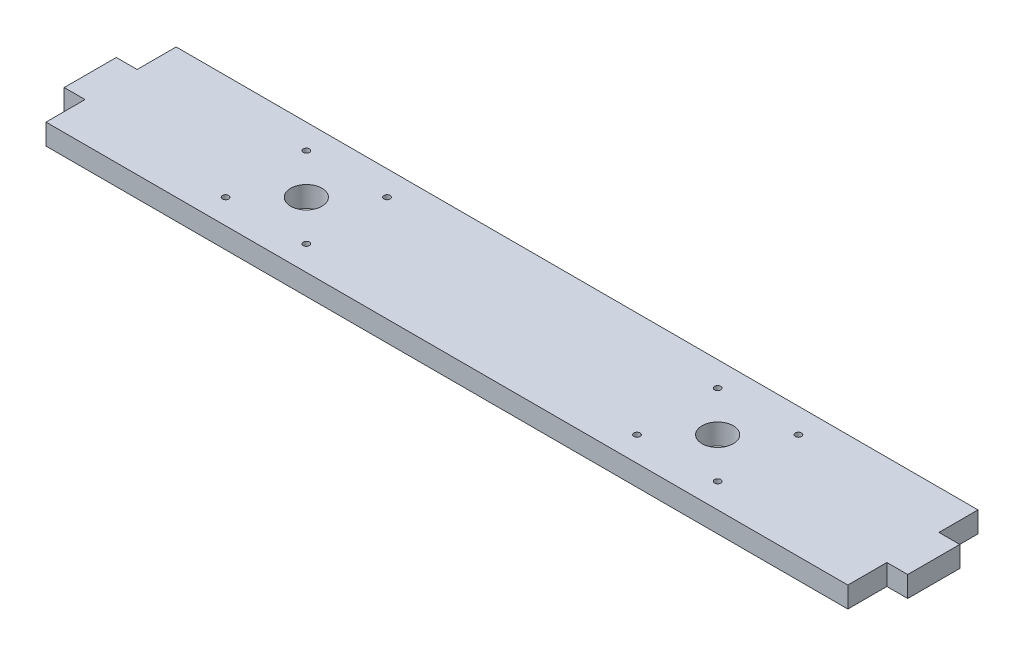
ISO-10303-21;
HEADER;
FILE_DESCRIPTION(('STEP AP214'),'2;1');
FILE_NAME('part.step','',(''),(''),'','','');
FILE_SCHEMA(('AUTOMOTIVE_DESIGN { 1 0 10303 214 1 1 1 1 }'));
ENDSEC;
DATA;
#1=APPLICATION_CONTEXT('core data for automotive mechanical design processes');
#2=APPLICATION_PROTOCOL_DEFINITION('international standard','automotive_design',2000,#1);
#3=PRODUCT_CONTEXT('',#1,'mechanical');
#4=PRODUCT('Part','Part','',(#3));
#5=PRODUCT_RELATED_PRODUCT_CATEGORY('part','',(#4));
#6=PRODUCT_DEFINITION_FORMATION('','',#4);
#7=PRODUCT_DEFINITION_CONTEXT('part definition',#1,'design');
#8=PRODUCT_DEFINITION('design','',#6,#7);
#9=PRODUCT_DEFINITION_SHAPE('','',#8);
#10=(LENGTH_UNIT() NAMED_UNIT(*) SI_UNIT(.MILLI.,.METRE.));
#11=(NAMED_UNIT(*) PLANE_ANGLE_UNIT() SI_UNIT($,.RADIAN.));
#12=(NAMED_UNIT(*) SI_UNIT($,.STERADIAN.) SOLID_ANGLE_UNIT());
#13=UNCERTAINTY_MEASURE_WITH_UNIT(LENGTH_MEASURE(1.E-05),#10,'distance_accuracy_value','');
#14=(GEOMETRIC_REPRESENTATION_CONTEXT(3) GLOBAL_UNCERTAINTY_ASSIGNED_CONTEXT((#13)) GLOBAL_UNIT_ASSIGNED_CONTEXT((#10,
#11,#12)) REPRESENTATION_CONTEXT('',''));
#15=CARTESIAN_POINT('',(0.,0.,0.));
#16=DIRECTION('',(0.,0.,1.));
#17=DIRECTION('',(1.,0.,0.));
#18=AXIS2_PLACEMENT_3D('',#15,#16,#17);
#19=CARTESIAN_POINT('',(308.,8.,0.));
#20=DIRECTION('',(-1.,0.,0.));
#21=DIRECTION('',(0.,0.,1.));
#22=AXIS2_PLACEMENT_3D('',#19,#20,#21);
#23=PLANE('',#22);
#24=DIRECTION('',(0.,1.,0.));
#25=VECTOR('',#24,1.);
#26=CARTESIAN_POINT('',(308.,0.,-35.));
#27=LINE('',#26,#25);
#28=CARTESIAN_POINT('',(308.,0.,-35.));
#29=VERTEX_POINT('',#28);
#30=CARTESIAN_POINT('',(308.,8.,-35.));
#31=VERTEX_POINT('',#30);
#32=EDGE_CURVE('E124',#29,#31,#27,.T.);
#33=ORIENTED_EDGE('',*,*,#32,.F.);
#34=DIRECTION('',(0.,0.,-1.));
#35=VECTOR('',#34,1.);
#36=CARTESIAN_POINT('',(308.,0.,0.));
#37=LINE('',#36,#35);
#38=CARTESIAN_POINT('',(308.,0.,-50.));
#39=VERTEX_POINT('',#38);
#40=EDGE_CURVE('E137',#29,#39,#37,.T.);
#41=ORIENTED_EDGE('',*,*,#40,.T.);
#42=DIRECTION('',(0.,-1.,0.));
#43=VECTOR('',#42,1.);
#44=CARTESIAN_POINT('',(308.,8.,-50.));
#45=LINE('',#44,#43);
#46=CARTESIAN_POINT('',(308.,8.,-50.));
#47=VERTEX_POINT('',#46);
#48=EDGE_CURVE('E170',#47,#39,#45,.T.);
#49=ORIENTED_EDGE('',*,*,#48,.F.);
#50=DIRECTION('',(0.,0.,-1.));
#51=VECTOR('',#50,1.);
#52=CARTESIAN_POINT('',(308.,8.,0.));
#53=LINE('',#52,#51);
#54=EDGE_CURVE('E139',#31,#47,#53,.T.);
#55=ORIENTED_EDGE('',*,*,#54,.F.);
#56=EDGE_LOOP('',(#33,#41,#49,#55));
#57=FACE_BOUND('',#56,.T.);
#58=ADVANCED_FACE('F30',(#57),#23,.F.);
#59=CARTESIAN_POINT('',(0.,8.,0.));
#60=DIRECTION('',(1.,0.,0.));
#61=DIRECTION('',(0.,0.,-1.));
#62=AXIS2_PLACEMENT_3D('',#59,#60,#61);
#63=PLANE('',#62);
#64=DIRECTION('',(0.,1.,0.));
#65=VECTOR('',#64,1.);
#66=CARTESIAN_POINT('',(0.,0.,-15.));
#67=LINE('',#66,#65);
#68=CARTESIAN_POINT('',(0.,0.,-15.));
#69=VERTEX_POINT('',#68);
#70=CARTESIAN_POINT('',(0.,8.,-15.));
#71=VERTEX_POINT('',#70);
#72=EDGE_CURVE('E262',#69,#71,#67,.T.);
#73=ORIENTED_EDGE('',*,*,#72,.F.);
#74=DIRECTION('',(0.,0.,1.));
#75=VECTOR('',#74,1.);
#76=CARTESIAN_POINT('',(0.,0.,0.));
#77=LINE('',#76,#75);
#78=CARTESIAN_POINT('',(0.,0.,0.));
#79=VERTEX_POINT('',#78);
#80=EDGE_CURVE('E177',#69,#79,#77,.T.);
#81=ORIENTED_EDGE('',*,*,#80,.T.);
#82=DIRECTION('',(0.,-1.,0.));
#83=VECTOR('',#82,1.);
#84=CARTESIAN_POINT('',(0.,8.,0.));
#85=LINE('',#84,#83);
#86=CARTESIAN_POINT('',(0.,8.,0.));
#87=VERTEX_POINT('',#86);
#88=EDGE_CURVE('E11',#87,#79,#85,.T.);
#89=ORIENTED_EDGE('',*,*,#88,.F.);
#90=DIRECTION('',(0.,0.,1.));
#91=VECTOR('',#90,1.);
#92=CARTESIAN_POINT('',(0.,8.,0.));
#93=LINE('',#92,#91);
#94=EDGE_CURVE('E166',#71,#87,#93,.T.);
#95=ORIENTED_EDGE('',*,*,#94,.F.);
#96=EDGE_LOOP('',(#73,#81,#89,#95));
#97=FACE_BOUND('',#96,.T.);
#98=ADVANCED_FACE('F261',(#97),#63,.F.);
#99=CARTESIAN_POINT('',(0.,8.,-50.));
#100=DIRECTION('',(0.,-1.,0.));
#101=DIRECTION('',(0.,0.,-1.));
#102=AXIS2_PLACEMENT_3D('',#99,#100,#101);
#103=PLANE('',#102);
#104=CARTESIAN_POINT('',(233.,8.,-25.));
#105=DIRECTION('',(0.,1.,0.));
#106=DIRECTION('',(0.,0.,-1.));
#107=AXIS2_PLACEMENT_3D('',#104,#105,#106);
#108=CIRCLE('',#107,5.99999999999999);
#109=CARTESIAN_POINT('',(233.,8.,-31.));
#110=VERTEX_POINT('',#109);
#111=EDGE_CURVE('E534',#110,#110,#108,.T.);
#112=ORIENTED_EDGE('',*,*,#111,.F.);
#113=EDGE_LOOP('',(#112));
#114=FACE_BOUND('',#113,.T.);
#115=CARTESIAN_POINT('',(248.5,8.,-9.5));
#116=DIRECTION('',(0.,1.,0.));
#117=DIRECTION('',(0.,0.,-1.));
#118=AXIS2_PLACEMENT_3D('',#115,#116,#117);
#119=CIRCLE('',#118,1.20000000000001);
#120=CARTESIAN_POINT('',(248.5,8.,-10.7));
#121=VERTEX_POINT('',#120);
#122=EDGE_CURVE('E547',#121,#121,#119,.T.);
#123=ORIENTED_EDGE('',*,*,#122,.F.);
#124=EDGE_LOOP('',(#123));
#125=FACE_BOUND('',#124,.T.);
#126=CARTESIAN_POINT('',(59.5000000000003,8.,-9.5));
#127=DIRECTION('',(0.,1.,0.));
#128=DIRECTION('',(0.,0.,1.));
#129=AXIS2_PLACEMENT_3D('',#126,#127,#128);
#130=CIRCLE('',#129,1.2);
#131=CARTESIAN_POINT('',(59.5000000000003,8.,-8.3));
#132=VERTEX_POINT('',#131);
#133=EDGE_CURVE('E559',#132,#132,#130,.T.);
#134=ORIENTED_EDGE('',*,*,#133,.F.);
#135=EDGE_LOOP('',(#134));
#136=FACE_BOUND('',#135,.T.);
#137=CARTESIAN_POINT('',(217.5,8.,-9.5));
#138=DIRECTION('',(0.,1.,0.));
#139=DIRECTION('',(0.,0.,-1.));
#140=AXIS2_PLACEMENT_3D('',#137,#138,#139);
#141=CIRCLE('',#140,1.20000000000001);
#142=CARTESIAN_POINT('',(217.5,8.,-10.7));
#143=VERTEX_POINT('',#142);
#144=EDGE_CURVE('E571',#143,#143,#141,.T.);
#145=ORIENTED_EDGE('',*,*,#144,.F.);
#146=EDGE_LOOP('',(#145));
#147=FACE_BOUND('',#146,.T.);
#148=CARTESIAN_POINT('',(75.,8.,-25.));
#149=DIRECTION('',(0.,1.,0.));
#150=DIRECTION('',(0.,0.,1.));
#151=AXIS2_PLACEMENT_3D('',#148,#149,#150);
#152=CIRCLE('',#151,6.);
#153=CARTESIAN_POINT('',(75.,8.,-19.));
#154=VERTEX_POINT('',#153);
#155=EDGE_CURVE('E239',#154,#154,#152,.T.);
#156=ORIENTED_EDGE('',*,*,#155,.F.);
#157=EDGE_LOOP('',(#156));
#158=FACE_BOUND('',#157,.T.);
#159=CARTESIAN_POINT('',(0.,8.,-50.));
#160=VERTEX_POINT('',#159);
#161=CARTESIAN_POINT('',(0.,8.,-35.));
#162=VERTEX_POINT('',#161);
#163=EDGE_CURVE('E254',#160,#162,#93,.T.);
#164=ORIENTED_EDGE('',*,*,#163,.T.);
#165=DIRECTION('',(-1.,0.,0.));
#166=VECTOR('',#165,1.);
#167=CARTESIAN_POINT('',(0.,8.,-35.));
#168=LINE('',#167,#166);
#169=CARTESIAN_POINT('',(-8.,8.,-35.));
#170=VERTEX_POINT('',#169);
#171=EDGE_CURVE('E55',#162,#170,#168,.T.);
#172=ORIENTED_EDGE('',*,*,#171,.T.);
#173=DIRECTION('',(0.,0.,1.));
#174=VECTOR('',#173,1.);
#175=CARTESIAN_POINT('',(-8.,8.,-35.));
#176=LINE('',#175,#174);
#177=CARTESIAN_POINT('',(-8.,8.,-15.));
#178=VERTEX_POINT('',#177);
#179=EDGE_CURVE('E217',#170,#178,#176,.T.);
#180=ORIENTED_EDGE('',*,*,#179,.T.);
#181=DIRECTION('',(1.,0.,0.));
#182=VECTOR('',#181,1.);
#183=CARTESIAN_POINT('',(0.,8.,-15.));
#184=LINE('',#183,#182);
#185=EDGE_CURVE('E260',#178,#71,#184,.T.);
#186=ORIENTED_EDGE('',*,*,#185,.T.);
#187=ORIENTED_EDGE('',*,*,#94,.T.);
#188=DIRECTION('',(1.,0.,0.));
#189=VECTOR('',#188,1.);
#190=CARTESIAN_POINT('',(0.,8.,0.));
#191=LINE('',#190,#189);
#192=CARTESIAN_POINT('',(308.,8.,0.));
#193=VERTEX_POINT('',#192);
#194=EDGE_CURVE('E184',#87,#193,#191,.T.);
#195=ORIENTED_EDGE('',*,*,#194,.T.);
#196=CARTESIAN_POINT('',(308.,8.,-15.));
#197=VERTEX_POINT('',#196);
#198=EDGE_CURVE('E158',#193,#197,#53,.T.);
#199=ORIENTED_EDGE('',*,*,#198,.T.);
#200=DIRECTION('',(1.,0.,0.));
#201=VECTOR('',#200,1.);
#202=CARTESIAN_POINT('',(308.,8.,-15.));
#203=LINE('',#202,#201);
#204=CARTESIAN_POINT('',(316.,8.,-15.));
#205=VERTEX_POINT('',#204);
#206=EDGE_CURVE('E47',#197,#205,#203,.T.);
#207=ORIENTED_EDGE('',*,*,#206,.T.);
#208=DIRECTION('',(0.,0.,-1.));
#209=VECTOR('',#208,1.);
#210=CARTESIAN_POINT('',(316.,8.,-35.));
#211=LINE('',#210,#209);
#212=CARTESIAN_POINT('',(316.,8.,-35.));
#213=VERTEX_POINT('',#212);
#214=EDGE_CURVE('E132',#205,#213,#211,.T.);
#215=ORIENTED_EDGE('',*,*,#214,.T.);
#216=DIRECTION('',(-1.,0.,0.));
#217=VECTOR('',#216,1.);
#218=CARTESIAN_POINT('',(308.,8.,-35.));
#219=LINE('',#218,#217);
#220=EDGE_CURVE('E189',#213,#31,#219,.T.);
#221=ORIENTED_EDGE('',*,*,#220,.T.);
#222=ORIENTED_EDGE('',*,*,#54,.T.);
#223=DIRECTION('',(-1.,0.,0.));
#224=VECTOR('',#223,1.);
#225=CARTESIAN_POINT('',(0.,8.,-50.));
#226=LINE('',#225,#224);
#227=EDGE_CURVE('E171',#47,#160,#226,.T.);
#228=ORIENTED_EDGE('',*,*,#227,.T.);
#229=EDGE_LOOP('',(#164,#172,#180,#186,#187,#195,#199,#207,#215,#221,#222,#228));
#230=FACE_BOUND('',#229,.T.);
#231=CARTESIAN_POINT('',(59.5,8.,-40.5));
#232=DIRECTION('',(0.,1.,0.));
#233=DIRECTION('',(0.,0.,1.));
#234=AXIS2_PLACEMENT_3D('',#231,#232,#233);
#235=CIRCLE('',#234,1.2);
#236=CARTESIAN_POINT('',(59.5,8.,-39.3));
#237=VERTEX_POINT('',#236);
#238=EDGE_CURVE('E246',#237,#237,#235,.T.);
#239=ORIENTED_EDGE('',*,*,#238,.F.);
#240=EDGE_LOOP('',(#239));
#241=FACE_BOUND('',#240,.T.);
#242=CARTESIAN_POINT('',(90.5,8.,-40.5));
#243=DIRECTION('',(0.,1.,0.));
#244=DIRECTION('',(0.,0.,1.));
#245=AXIS2_PLACEMENT_3D('',#242,#243,#244);
#246=CIRCLE('',#245,1.2);
#247=CARTESIAN_POINT('',(90.5,8.,-39.3));
#248=VERTEX_POINT('',#247);
#249=EDGE_CURVE('E565',#248,#248,#246,.T.);
#250=ORIENTED_EDGE('',*,*,#249,.F.);
#251=EDGE_LOOP('',(#250));
#252=FACE_BOUND('',#251,.T.);
#253=CARTESIAN_POINT('',(90.5000000000003,8.,-9.5));
#254=DIRECTION('',(0.,1.,0.));
#255=DIRECTION('',(0.,0.,1.));
#256=AXIS2_PLACEMENT_3D('',#253,#254,#255);
#257=CIRCLE('',#256,1.2);
#258=CARTESIAN_POINT('',(90.5000000000003,8.,-8.3));
#259=VERTEX_POINT('',#258);
#260=EDGE_CURVE('E553',#259,#259,#257,.T.);
#261=ORIENTED_EDGE('',*,*,#260,.F.);
#262=EDGE_LOOP('',(#261));
#263=FACE_BOUND('',#262,.T.);
#264=CARTESIAN_POINT('',(217.5,8.,-40.5));
#265=DIRECTION('',(0.,1.,0.));
#266=DIRECTION('',(0.,0.,-1.));
#267=AXIS2_PLACEMENT_3D('',#264,#265,#266);
#268=CIRCLE('',#267,1.20000000000001);
#269=CARTESIAN_POINT('',(217.5,8.,-41.7));
#270=VERTEX_POINT('',#269);
#271=EDGE_CURVE('E541',#270,#270,#268,.T.);
#272=ORIENTED_EDGE('',*,*,#271,.F.);
#273=EDGE_LOOP('',(#272));
#274=FACE_BOUND('',#273,.T.);
#275=CARTESIAN_POINT('',(248.5,8.,-40.5));
#276=DIRECTION('',(0.,1.,0.));
#277=DIRECTION('',(0.,0.,-1.));
#278=AXIS2_PLACEMENT_3D('',#275,#276,#277);
#279=CIRCLE('',#278,1.20000000000001);
#280=CARTESIAN_POINT('',(248.5,8.,-41.7));
#281=VERTEX_POINT('',#280);
#282=EDGE_CURVE('E268',#281,#281,#279,.T.);
#283=ORIENTED_EDGE('',*,*,#282,.F.);
#284=EDGE_LOOP('',(#283));
#285=FACE_BOUND('',#284,.T.);
#286=ADVANCED_FACE('F210',(#114,#125,#136,#147,#158,#230,#241,#252,#263,#274,#285),#103,.F.);
#287=CARTESIAN_POINT('',(0.,0.,-50.));
#288=DIRECTION('',(0.,-1.,0.));
#289=DIRECTION('',(0.,0.,-1.));
#290=AXIS2_PLACEMENT_3D('',#287,#288,#289);
#291=PLANE('',#290);
#292=CARTESIAN_POINT('',(233.,0.,-25.));
#293=DIRECTION('',(0.,1.,0.));
#294=DIRECTION('',(0.,0.,-1.));
#295=AXIS2_PLACEMENT_3D('',#292,#293,#294);
#296=CIRCLE('',#295,5.99999999999999);
#297=CARTESIAN_POINT('',(233.,0.,-31.));
#298=VERTEX_POINT('',#297);
#299=EDGE_CURVE('E533',#298,#298,#296,.T.);
#300=ORIENTED_EDGE('',*,*,#299,.T.);
#301=EDGE_LOOP('',(#300));
#302=FACE_BOUND('',#301,.T.);
#303=CARTESIAN_POINT('',(248.5,0.,-9.5));
#304=DIRECTION('',(0.,1.,0.));
#305=DIRECTION('',(0.,0.,-1.));
#306=AXIS2_PLACEMENT_3D('',#303,#304,#305);
#307=CIRCLE('',#306,1.20000000000001);
#308=CARTESIAN_POINT('',(248.5,0.,-10.7));
#309=VERTEX_POINT('',#308);
#310=EDGE_CURVE('E544',#309,#309,#307,.T.);
#311=ORIENTED_EDGE('',*,*,#310,.T.);
#312=EDGE_LOOP('',(#311));
#313=FACE_BOUND('',#312,.T.);
#314=CARTESIAN_POINT('',(59.5000000000003,0.,-9.5));
#315=DIRECTION('',(0.,1.,0.));
#316=DIRECTION('',(0.,0.,1.));
#317=AXIS2_PLACEMENT_3D('',#314,#315,#316);
#318=CIRCLE('',#317,1.2);
#319=CARTESIAN_POINT('',(59.5000000000003,0.,-8.3));
#320=VERTEX_POINT('',#319);
#321=EDGE_CURVE('E556',#320,#320,#318,.T.);
#322=ORIENTED_EDGE('',*,*,#321,.T.);
#323=EDGE_LOOP('',(#322));
#324=FACE_BOUND('',#323,.T.);
#325=CARTESIAN_POINT('',(217.5,0.,-9.5));
#326=DIRECTION('',(0.,1.,0.));
#327=DIRECTION('',(0.,0.,-1.));
#328=AXIS2_PLACEMENT_3D('',#325,#326,#327);
#329=CIRCLE('',#328,1.20000000000001);
#330=CARTESIAN_POINT('',(217.5,0.,-10.7));
#331=VERTEX_POINT('',#330);
#332=EDGE_CURVE('E568',#331,#331,#329,.T.);
#333=ORIENTED_EDGE('',*,*,#332,.T.);
#334=EDGE_LOOP('',(#333));
#335=FACE_BOUND('',#334,.T.);
#336=CARTESIAN_POINT('',(75.,0.,-25.));
#337=DIRECTION('',(0.,1.,0.));
#338=DIRECTION('',(0.,0.,1.));
#339=AXIS2_PLACEMENT_3D('',#336,#337,#338);
#340=CIRCLE('',#339,6.);
#341=CARTESIAN_POINT('',(75.,0.,-19.));
#342=VERTEX_POINT('',#341);
#343=EDGE_CURVE('E241',#342,#342,#340,.T.);
#344=ORIENTED_EDGE('',*,*,#343,.T.);
#345=EDGE_LOOP('',(#344));
#346=FACE_BOUND('',#345,.T.);
#347=CARTESIAN_POINT('',(0.,0.,-50.));
#348=VERTEX_POINT('',#347);
#349=CARTESIAN_POINT('',(0.,0.,-35.));
#350=VERTEX_POINT('',#349);
#351=EDGE_CURVE('E153',#348,#350,#77,.T.);
#352=ORIENTED_EDGE('',*,*,#351,.F.);
#353=DIRECTION('',(-1.,0.,0.));
#354=VECTOR('',#353,1.);
#355=CARTESIAN_POINT('',(0.,0.,-50.));
#356=LINE('',#355,#354);
#357=EDGE_CURVE('E147',#39,#348,#356,.T.);
#358=ORIENTED_EDGE('',*,*,#357,.F.);
#359=ORIENTED_EDGE('',*,*,#40,.F.);
#360=DIRECTION('',(-1.,0.,0.));
#361=VECTOR('',#360,1.);
#362=CARTESIAN_POINT('',(308.,0.,-35.));
#363=LINE('',#362,#361);
#364=CARTESIAN_POINT('',(316.,0.,-35.));
#365=VERTEX_POINT('',#364);
#366=EDGE_CURVE('E120',#365,#29,#363,.T.);
#367=ORIENTED_EDGE('',*,*,#366,.F.);
#368=DIRECTION('',(0.,0.,-1.));
#369=VECTOR('',#368,1.);
#370=CARTESIAN_POINT('',(316.,0.,-35.));
#371=LINE('',#370,#369);
#372=CARTESIAN_POINT('',(316.,0.,-15.));
#373=VERTEX_POINT('',#372);
#374=EDGE_CURVE('E141',#373,#365,#371,.T.);
#375=ORIENTED_EDGE('',*,*,#374,.F.);
#376=DIRECTION('',(1.,0.,0.));
#377=VECTOR('',#376,1.);
#378=CARTESIAN_POINT('',(308.,0.,-15.));
#379=LINE('',#378,#377);
#380=CARTESIAN_POINT('',(308.,0.,-15.));
#381=VERTEX_POINT('',#380);
#382=EDGE_CURVE('E131',#381,#373,#379,.T.);
#383=ORIENTED_EDGE('',*,*,#382,.F.);
#384=CARTESIAN_POINT('',(308.,0.,0.));
#385=VERTEX_POINT('',#384);
#386=EDGE_CURVE('E148',#385,#381,#37,.T.);
#387=ORIENTED_EDGE('',*,*,#386,.F.);
#388=DIRECTION('',(1.,0.,0.));
#389=VECTOR('',#388,1.);
#390=CARTESIAN_POINT('',(0.,0.,0.));
#391=LINE('',#390,#389);
#392=EDGE_CURVE('E149',#79,#385,#391,.T.);
#393=ORIENTED_EDGE('',*,*,#392,.F.);
#394=ORIENTED_EDGE('',*,*,#80,.F.);
#395=DIRECTION('',(1.,0.,0.));
#396=VECTOR('',#395,1.);
#397=CARTESIAN_POINT('',(0.,0.,-15.));
#398=LINE('',#397,#396);
#399=CARTESIAN_POINT('',(-8.,0.,-15.));
#400=VERTEX_POINT('',#399);
#401=EDGE_CURVE('E236',#400,#69,#398,.T.);
#402=ORIENTED_EDGE('',*,*,#401,.F.);
#403=DIRECTION('',(0.,0.,1.));
#404=VECTOR('',#403,1.);
#405=CARTESIAN_POINT('',(-8.,0.,-35.));
#406=LINE('',#405,#404);
#407=CARTESIAN_POINT('',(-8.,0.,-35.));
#408=VERTEX_POINT('',#407);
#409=EDGE_CURVE('E202',#408,#400,#406,.T.);
#410=ORIENTED_EDGE('',*,*,#409,.F.);
#411=DIRECTION('',(-1.,0.,0.));
#412=VECTOR('',#411,1.);
#413=CARTESIAN_POINT('',(0.,0.,-35.));
#414=LINE('',#413,#412);
#415=EDGE_CURVE('E287',#350,#408,#414,.T.);
#416=ORIENTED_EDGE('',*,*,#415,.F.);
#417=EDGE_LOOP('',(#352,#358,#359,#367,#375,#383,#387,#393,#394,#402,#410,#416));
#418=FACE_BOUND('',#417,.T.);
#419=CARTESIAN_POINT('',(59.5,0.,-40.5));
#420=DIRECTION('',(0.,1.,0.));
#421=DIRECTION('',(0.,0.,1.));
#422=AXIS2_PLACEMENT_3D('',#419,#420,#421);
#423=CIRCLE('',#422,1.2);
#424=CARTESIAN_POINT('',(59.5,0.,-39.3));
#425=VERTEX_POINT('',#424);
#426=EDGE_CURVE('E249',#425,#425,#423,.T.);
#427=ORIENTED_EDGE('',*,*,#426,.T.);
#428=EDGE_LOOP('',(#427));
#429=FACE_BOUND('',#428,.T.);
#430=CARTESIAN_POINT('',(90.5,0.,-40.5));
#431=DIRECTION('',(0.,1.,0.));
#432=DIRECTION('',(0.,0.,1.));
#433=AXIS2_PLACEMENT_3D('',#430,#431,#432);
#434=CIRCLE('',#433,1.2);
#435=CARTESIAN_POINT('',(90.5,0.,-39.3));
#436=VERTEX_POINT('',#435);
#437=EDGE_CURVE('E562',#436,#436,#434,.T.);
#438=ORIENTED_EDGE('',*,*,#437,.T.);
#439=EDGE_LOOP('',(#438));
#440=FACE_BOUND('',#439,.T.);
#441=CARTESIAN_POINT('',(90.5000000000003,0.,-9.5));
#442=DIRECTION('',(0.,1.,0.));
#443=DIRECTION('',(0.,0.,1.));
#444=AXIS2_PLACEMENT_3D('',#441,#442,#443);
#445=CIRCLE('',#444,1.2);
#446=CARTESIAN_POINT('',(90.5000000000003,0.,-8.3));
#447=VERTEX_POINT('',#446);
#448=EDGE_CURVE('E550',#447,#447,#445,.T.);
#449=ORIENTED_EDGE('',*,*,#448,.T.);
#450=EDGE_LOOP('',(#449));
#451=FACE_BOUND('',#450,.T.);
#452=CARTESIAN_POINT('',(217.5,0.,-40.5));
#453=DIRECTION('',(0.,1.,0.));
#454=DIRECTION('',(0.,0.,-1.));
#455=AXIS2_PLACEMENT_3D('',#452,#453,#454);
#456=CIRCLE('',#455,1.20000000000001);
#457=CARTESIAN_POINT('',(217.5,0.,-41.7));
#458=VERTEX_POINT('',#457);
#459=EDGE_CURVE('E538',#458,#458,#456,.T.);
#460=ORIENTED_EDGE('',*,*,#459,.T.);
#461=EDGE_LOOP('',(#460));
#462=FACE_BOUND('',#461,.T.);
#463=CARTESIAN_POINT('',(248.5,0.,-40.5));
#464=DIRECTION('',(0.,1.,0.));
#465=DIRECTION('',(0.,0.,-1.));
#466=AXIS2_PLACEMENT_3D('',#463,#464,#465);
#467=CIRCLE('',#466,1.20000000000001);
#468=CARTESIAN_POINT('',(248.5,0.,-41.7));
#469=VERTEX_POINT('',#468);
#470=EDGE_CURVE('E264',#469,#469,#467,.T.);
#471=ORIENTED_EDGE('',*,*,#470,.T.);
#472=EDGE_LOOP('',(#471));
#473=FACE_BOUND('',#472,.T.);
#474=ADVANCED_FACE('F145',(#302,#313,#324,#335,#346,#418,#429,#440,#451,#462,#473),#291,.T.);
#475=ORIENTED_EDGE('',*,*,#351,.T.);
#476=DIRECTION('',(0.,1.,0.));
#477=VECTOR('',#476,1.);
#478=CARTESIAN_POINT('',(0.,0.,-35.));
#479=LINE('',#478,#477);
#480=EDGE_CURVE('E281',#350,#162,#479,.T.);
#481=ORIENTED_EDGE('',*,*,#480,.T.);
#482=ORIENTED_EDGE('',*,*,#163,.F.);
#483=DIRECTION('',(0.,-1.,0.));
#484=VECTOR('',#483,1.);
#485=CARTESIAN_POINT('',(0.,8.,-50.));
#486=LINE('',#485,#484);
#487=EDGE_CURVE('E167',#160,#348,#486,.T.);
#488=ORIENTED_EDGE('',*,*,#487,.T.);
#489=EDGE_LOOP('',(#475,#481,#482,#488));
#490=FACE_BOUND('',#489,.T.);
#491=ADVANCED_FACE('F32',(#490),#63,.F.);
#492=CARTESIAN_POINT('',(0.,8.,0.));
#493=DIRECTION('',(0.,0.,-1.));
#494=DIRECTION('',(-1.,0.,0.));
#495=AXIS2_PLACEMENT_3D('',#492,#493,#494);
#496=PLANE('',#495);
#497=ORIENTED_EDGE('',*,*,#392,.T.);
#498=DIRECTION('',(0.,-1.,0.));
#499=VECTOR('',#498,1.);
#500=CARTESIAN_POINT('',(308.,8.,0.));
#501=LINE('',#500,#499);
#502=EDGE_CURVE('E39',#193,#385,#501,.T.);
#503=ORIENTED_EDGE('',*,*,#502,.F.);
#504=ORIENTED_EDGE('',*,*,#194,.F.);
#505=ORIENTED_EDGE('',*,*,#88,.T.);
#506=EDGE_LOOP('',(#497,#503,#504,#505));
#507=FACE_BOUND('',#506,.T.);
#508=ADVANCED_FACE('F231',(#507),#496,.F.);
#509=ORIENTED_EDGE('',*,*,#386,.T.);
#510=DIRECTION('',(0.,1.,0.));
#511=VECTOR('',#510,1.);
#512=CARTESIAN_POINT('',(308.,0.,-15.));
#513=LINE('',#512,#511);
#514=EDGE_CURVE('E140',#381,#197,#513,.T.);
#515=ORIENTED_EDGE('',*,*,#514,.T.);
#516=ORIENTED_EDGE('',*,*,#198,.F.);
#517=ORIENTED_EDGE('',*,*,#502,.T.);
#518=EDGE_LOOP('',(#509,#515,#516,#517));
#519=FACE_BOUND('',#518,.T.);
#520=ADVANCED_FACE('F226',(#519),#23,.F.);
#521=CARTESIAN_POINT('',(0.,8.,-50.));
#522=DIRECTION('',(0.,0.,1.));
#523=DIRECTION('',(1.,0.,0.));
#524=AXIS2_PLACEMENT_3D('',#521,#522,#523);
#525=PLANE('',#524);
#526=ORIENTED_EDGE('',*,*,#357,.T.);
#527=ORIENTED_EDGE('',*,*,#487,.F.);
#528=ORIENTED_EDGE('',*,*,#227,.F.);
#529=ORIENTED_EDGE('',*,*,#48,.T.);
#530=EDGE_LOOP('',(#526,#527,#528,#529));
#531=FACE_BOUND('',#530,.T.);
#532=ADVANCED_FACE('F302',(#531),#525,.F.);
#533=CARTESIAN_POINT('',(75.,8.,-25.));
#534=DIRECTION('',(0.,-1.,0.));
#535=DIRECTION('',(0.,0.,-1.));
#536=AXIS2_PLACEMENT_3D('',#533,#534,#535);
#537=CYLINDRICAL_SURFACE('',#536,6.);
#538=ORIENTED_EDGE('',*,*,#155,.T.);
#539=EDGE_LOOP('',(#538));
#540=FACE_BOUND('',#539,.T.);
#541=ORIENTED_EDGE('',*,*,#343,.F.);
#542=EDGE_LOOP('',(#541));
#543=FACE_BOUND('',#542,.T.);
#544=ADVANCED_FACE('F304',(#540,#543),#537,.F.);
#545=CARTESIAN_POINT('',(59.5,8.,-40.5));
#546=DIRECTION('',(0.,-1.,0.));
#547=DIRECTION('',(0.,0.,-1.));
#548=AXIS2_PLACEMENT_3D('',#545,#546,#547);
#549=CYLINDRICAL_SURFACE('',#548,1.2);
#550=ORIENTED_EDGE('',*,*,#238,.T.);
#551=EDGE_LOOP('',(#550));
#552=FACE_BOUND('',#551,.T.);
#553=ORIENTED_EDGE('',*,*,#426,.F.);
#554=EDGE_LOOP('',(#553));
#555=FACE_BOUND('',#554,.T.);
#556=ADVANCED_FACE('F310',(#552,#555),#549,.F.);
#557=CARTESIAN_POINT('',(217.5,8.,-9.5));
#558=DIRECTION('',(0.,-1.,0.));
#559=DIRECTION('',(0.,0.,-1.));
#560=AXIS2_PLACEMENT_3D('',#557,#558,#559);
#561=CYLINDRICAL_SURFACE('',#560,1.20000000000001);
#562=ORIENTED_EDGE('',*,*,#144,.T.);
#563=EDGE_LOOP('',(#562));
#564=FACE_BOUND('',#563,.T.);
#565=ORIENTED_EDGE('',*,*,#332,.F.);
#566=EDGE_LOOP('',(#565));
#567=FACE_BOUND('',#566,.T.);
#568=ADVANCED_FACE('F336',(#564,#567),#561,.F.);
#569=CARTESIAN_POINT('',(90.5,8.,-40.5));
#570=DIRECTION('',(0.,-1.,0.));
#571=DIRECTION('',(0.,0.,-1.));
#572=AXIS2_PLACEMENT_3D('',#569,#570,#571);
#573=CYLINDRICAL_SURFACE('',#572,1.2);
#574=ORIENTED_EDGE('',*,*,#249,.T.);
#575=EDGE_LOOP('',(#574));
#576=FACE_BOUND('',#575,.T.);
#577=ORIENTED_EDGE('',*,*,#437,.F.);
#578=EDGE_LOOP('',(#577));
#579=FACE_BOUND('',#578,.T.);
#580=ADVANCED_FACE('F340',(#576,#579),#573,.F.);
#581=CARTESIAN_POINT('',(59.5000000000003,8.,-9.5));
#582=DIRECTION('',(0.,-1.,0.));
#583=DIRECTION('',(0.,0.,-1.));
#584=AXIS2_PLACEMENT_3D('',#581,#582,#583);
#585=CYLINDRICAL_SURFACE('',#584,1.2);
#586=ORIENTED_EDGE('',*,*,#133,.T.);
#587=EDGE_LOOP('',(#586));
#588=FACE_BOUND('',#587,.T.);
#589=ORIENTED_EDGE('',*,*,#321,.F.);
#590=EDGE_LOOP('',(#589));
#591=FACE_BOUND('',#590,.T.);
#592=ADVANCED_FACE('F344',(#588,#591),#585,.F.);
#593=CARTESIAN_POINT('',(90.5000000000003,8.,-9.5));
#594=DIRECTION('',(0.,-1.,0.));
#595=DIRECTION('',(0.,0.,-1.));
#596=AXIS2_PLACEMENT_3D('',#593,#594,#595);
#597=CYLINDRICAL_SURFACE('',#596,1.2);
#598=ORIENTED_EDGE('',*,*,#260,.T.);
#599=EDGE_LOOP('',(#598));
#600=FACE_BOUND('',#599,.T.);
#601=ORIENTED_EDGE('',*,*,#448,.F.);
#602=EDGE_LOOP('',(#601));
#603=FACE_BOUND('',#602,.T.);
#604=ADVANCED_FACE('F348',(#600,#603),#597,.F.);
#605=CARTESIAN_POINT('',(248.5,8.,-9.5));
#606=DIRECTION('',(0.,-1.,0.));
#607=DIRECTION('',(0.,0.,-1.));
#608=AXIS2_PLACEMENT_3D('',#605,#606,#607);
#609=CYLINDRICAL_SURFACE('',#608,1.20000000000001);
#610=ORIENTED_EDGE('',*,*,#122,.T.);
#611=EDGE_LOOP('',(#610));
#612=FACE_BOUND('',#611,.T.);
#613=ORIENTED_EDGE('',*,*,#310,.F.);
#614=EDGE_LOOP('',(#613));
#615=FACE_BOUND('',#614,.T.);
#616=ADVANCED_FACE('F352',(#612,#615),#609,.F.);
#617=CARTESIAN_POINT('',(217.5,8.,-40.5));
#618=DIRECTION('',(0.,-1.,0.));
#619=DIRECTION('',(0.,0.,-1.));
#620=AXIS2_PLACEMENT_3D('',#617,#618,#619);
#621=CYLINDRICAL_SURFACE('',#620,1.20000000000001);
#622=ORIENTED_EDGE('',*,*,#271,.T.);
#623=EDGE_LOOP('',(#622));
#624=FACE_BOUND('',#623,.T.);
#625=ORIENTED_EDGE('',*,*,#459,.F.);
#626=EDGE_LOOP('',(#625));
#627=FACE_BOUND('',#626,.T.);
#628=ADVANCED_FACE('F356',(#624,#627),#621,.F.);
#629=CARTESIAN_POINT('',(233.,8.,-25.));
#630=DIRECTION('',(0.,-1.,0.));
#631=DIRECTION('',(0.,0.,-1.));
#632=AXIS2_PLACEMENT_3D('',#629,#630,#631);
#633=CYLINDRICAL_SURFACE('',#632,5.99999999999999);
#634=ORIENTED_EDGE('',*,*,#111,.T.);
#635=EDGE_LOOP('',(#634));
#636=FACE_BOUND('',#635,.T.);
#637=ORIENTED_EDGE('',*,*,#299,.F.);
#638=EDGE_LOOP('',(#637));
#639=FACE_BOUND('',#638,.T.);
#640=ADVANCED_FACE('F360',(#636,#639),#633,.F.);
#641=CARTESIAN_POINT('',(248.5,8.,-40.5));
#642=DIRECTION('',(0.,-1.,0.));
#643=DIRECTION('',(0.,0.,-1.));
#644=AXIS2_PLACEMENT_3D('',#641,#642,#643);
#645=CYLINDRICAL_SURFACE('',#644,1.20000000000001);
#646=ORIENTED_EDGE('',*,*,#282,.T.);
#647=EDGE_LOOP('',(#646));
#648=FACE_BOUND('',#647,.T.);
#649=ORIENTED_EDGE('',*,*,#470,.F.);
#650=EDGE_LOOP('',(#649));
#651=FACE_BOUND('',#650,.T.);
#652=ADVANCED_FACE('F364',(#648,#651),#645,.F.);
#653=CARTESIAN_POINT('',(0.,0.,-15.));
#654=DIRECTION('',(0.,0.,1.));
#655=DIRECTION('',(1.,0.,0.));
#656=AXIS2_PLACEMENT_3D('',#653,#654,#655);
#657=PLANE('',#656);
#658=ORIENTED_EDGE('',*,*,#185,.F.);
#659=DIRECTION('',(0.,1.,0.));
#660=VECTOR('',#659,1.);
#661=CARTESIAN_POINT('',(-8.,0.,-15.));
#662=LINE('',#661,#660);
#663=EDGE_CURVE('E265',#400,#178,#662,.T.);
#664=ORIENTED_EDGE('',*,*,#663,.F.);
#665=ORIENTED_EDGE('',*,*,#401,.T.);
#666=ORIENTED_EDGE('',*,*,#72,.T.);
#667=EDGE_LOOP('',(#658,#664,#665,#666));
#668=FACE_BOUND('',#667,.T.);
#669=ADVANCED_FACE('F296',(#668),#657,.T.);
#670=CARTESIAN_POINT('',(-8.,0.,-35.));
#671=DIRECTION('',(-1.,0.,0.));
#672=DIRECTION('',(0.,0.,1.));
#673=AXIS2_PLACEMENT_3D('',#670,#671,#672);
#674=PLANE('',#673);
#675=ORIENTED_EDGE('',*,*,#179,.F.);
#676=DIRECTION('',(0.,1.,0.));
#677=VECTOR('',#676,1.);
#678=CARTESIAN_POINT('',(-8.,0.,-35.));
#679=LINE('',#678,#677);
#680=EDGE_CURVE('E270',#408,#170,#679,.T.);
#681=ORIENTED_EDGE('',*,*,#680,.F.);
#682=ORIENTED_EDGE('',*,*,#409,.T.);
#683=ORIENTED_EDGE('',*,*,#663,.T.);
#684=EDGE_LOOP('',(#675,#681,#682,#683));
#685=FACE_BOUND('',#684,.T.);
#686=ADVANCED_FACE('F297',(#685),#674,.T.);
#687=CARTESIAN_POINT('',(0.,0.,-35.));
#688=DIRECTION('',(0.,0.,-1.));
#689=DIRECTION('',(-1.,0.,0.));
#690=AXIS2_PLACEMENT_3D('',#687,#688,#689);
#691=PLANE('',#690);
#692=ORIENTED_EDGE('',*,*,#171,.F.);
#693=ORIENTED_EDGE('',*,*,#480,.F.);
#694=ORIENTED_EDGE('',*,*,#415,.T.);
#695=ORIENTED_EDGE('',*,*,#680,.T.);
#696=EDGE_LOOP('',(#692,#693,#694,#695));
#697=FACE_BOUND('',#696,.T.);
#698=ADVANCED_FACE('F369',(#697),#691,.T.);
#699=CARTESIAN_POINT('',(308.,0.,-35.));
#700=DIRECTION('',(0.,0.,-1.));
#701=DIRECTION('',(-1.,0.,0.));
#702=AXIS2_PLACEMENT_3D('',#699,#700,#701);
#703=PLANE('',#702);
#704=ORIENTED_EDGE('',*,*,#220,.F.);
#705=DIRECTION('',(0.,1.,0.));
#706=VECTOR('',#705,1.);
#707=CARTESIAN_POINT('',(316.,0.,-35.));
#708=LINE('',#707,#706);
#709=EDGE_CURVE('E126',#365,#213,#708,.T.);
#710=ORIENTED_EDGE('',*,*,#709,.F.);
#711=ORIENTED_EDGE('',*,*,#366,.T.);
#712=ORIENTED_EDGE('',*,*,#32,.T.);
#713=EDGE_LOOP('',(#704,#710,#711,#712));
#714=FACE_BOUND('',#713,.T.);
#715=ADVANCED_FACE('F123',(#714),#703,.T.);
#716=CARTESIAN_POINT('',(316.,0.,-35.));
#717=DIRECTION('',(1.,0.,0.));
#718=DIRECTION('',(0.,0.,-1.));
#719=AXIS2_PLACEMENT_3D('',#716,#717,#718);
#720=PLANE('',#719);
#721=ORIENTED_EDGE('',*,*,#214,.F.);
#722=DIRECTION('',(0.,1.,0.));
#723=VECTOR('',#722,1.);
#724=CARTESIAN_POINT('',(316.,0.,-15.));
#725=LINE('',#724,#723);
#726=EDGE_CURVE('E194',#373,#205,#725,.T.);
#727=ORIENTED_EDGE('',*,*,#726,.F.);
#728=ORIENTED_EDGE('',*,*,#374,.T.);
#729=ORIENTED_EDGE('',*,*,#709,.T.);
#730=EDGE_LOOP('',(#721,#727,#728,#729));
#731=FACE_BOUND('',#730,.T.);
#732=ADVANCED_FACE('F222',(#731),#720,.T.);
#733=CARTESIAN_POINT('',(308.,0.,-15.));
#734=DIRECTION('',(0.,0.,1.));
#735=DIRECTION('',(1.,0.,0.));
#736=AXIS2_PLACEMENT_3D('',#733,#734,#735);
#737=PLANE('',#736);
#738=ORIENTED_EDGE('',*,*,#206,.F.);
#739=ORIENTED_EDGE('',*,*,#514,.F.);
#740=ORIENTED_EDGE('',*,*,#382,.T.);
#741=ORIENTED_EDGE('',*,*,#726,.T.);
#742=EDGE_LOOP('',(#738,#739,#740,#741));
#743=FACE_BOUND('',#742,.T.);
#744=ADVANCED_FACE('F220',(#743),#737,.T.);
#745=CLOSED_SHELL('',(#58,#98,#286,#474,#491,#508,#520,#532,#544,#556,#568,#580,#592,#604,#616,
#628,#640,#652,#669,#686,#698,#715,#732,#744));
#746=MANIFOLD_SOLID_BREP('B2',#745);
#747=ADVANCED_BREP_SHAPE_REPRESENTATION('',(#18,#746),#14);
#748=SHAPE_DEFINITION_REPRESENTATION(#9,#747);
ENDSEC;
END-ISO-10303-21;
